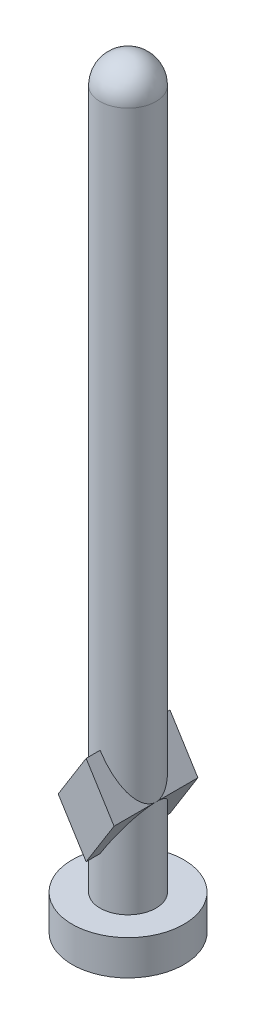
ISO-10303-21;
HEADER;
FILE_DESCRIPTION(('STEP AP214'),'2;1');
FILE_NAME('part.step','',(''),(''),'','','');
FILE_SCHEMA(('AUTOMOTIVE_DESIGN { 1 0 10303 214 1 1 1 1 }'));
ENDSEC;
DATA;
#1=APPLICATION_CONTEXT('core data for automotive mechanical design processes');
#2=APPLICATION_PROTOCOL_DEFINITION('international standard','automotive_design',2000,#1);
#3=PRODUCT_CONTEXT('',#1,'mechanical');
#4=PRODUCT('Part','Part','',(#3));
#5=PRODUCT_RELATED_PRODUCT_CATEGORY('part','',(#4));
#6=PRODUCT_DEFINITION_FORMATION('','',#4);
#7=PRODUCT_DEFINITION_CONTEXT('part definition',#1,'design');
#8=PRODUCT_DEFINITION('design','',#6,#7);
#9=PRODUCT_DEFINITION_SHAPE('','',#8);
#10=(LENGTH_UNIT() NAMED_UNIT(*) SI_UNIT(.MILLI.,.METRE.));
#11=(NAMED_UNIT(*) PLANE_ANGLE_UNIT() SI_UNIT($,.RADIAN.));
#12=(NAMED_UNIT(*) SI_UNIT($,.STERADIAN.) SOLID_ANGLE_UNIT());
#13=UNCERTAINTY_MEASURE_WITH_UNIT(LENGTH_MEASURE(1.E-05),#10,'distance_accuracy_value','');
#14=(GEOMETRIC_REPRESENTATION_CONTEXT(3) GLOBAL_UNCERTAINTY_ASSIGNED_CONTEXT((#13)) GLOBAL_UNIT_ASSIGNED_CONTEXT((#10,
#11,#12)) REPRESENTATION_CONTEXT('',''));
#15=CARTESIAN_POINT('',(0.,0.,0.));
#16=DIRECTION('',(0.,0.,1.));
#17=DIRECTION('',(1.,0.,0.));
#18=AXIS2_PLACEMENT_3D('',#15,#16,#17);
#19=CARTESIAN_POINT('',(0.,100.,0.));
#20=DIRECTION('',(0.,-1.,0.));
#21=DIRECTION('',(0.,0.,-1.));
#22=AXIS2_PLACEMENT_3D('',#19,#20,#21);
#23=CYLINDRICAL_SURFACE('',#22,4.);
#24=CARTESIAN_POINT('',(0.,6.75940967701019,0.));
#25=DIRECTION('',(-0.848236351407123,-0.529617873708518,0.));
#26=DIRECTION('',(0.529617873708518,-0.848236351407123,0.));
#27=AXIS2_PLACEMENT_3D('',#24,#25,#26);
#28=ELLIPSE('',#27,7.55261519402847,4.);
#29=CARTESIAN_POINT('',(-4.,13.1658124327749,0.));
#30=VERTEX_POINT('',#29);
#31=CARTESIAN_POINT('',(0.,6.75940967701025,-4.));
#32=VERTEX_POINT('',#31);
#33=EDGE_CURVE('E157',#30,#32,#28,.T.);
#34=ORIENTED_EDGE('',*,*,#33,.T.);
#35=CARTESIAN_POINT('',(0.,6.7594096770103,0.));
#36=DIRECTION('',(0.848236351407119,-0.529617873708525,0.));
#37=DIRECTION('',(-0.529617873708525,-0.848236351407119,0.));
#38=AXIS2_PLACEMENT_3D('',#35,#36,#37);
#39=ELLIPSE('',#38,7.55261519402837,4.);
#40=CARTESIAN_POINT('',(4.,13.1658124327749,0.));
#41=VERTEX_POINT('',#40);
#42=EDGE_CURVE('E50',#32,#41,#39,.T.);
#43=ORIENTED_EDGE('',*,*,#42,.T.);
#44=CARTESIAN_POINT('',(0.,6.75940967701025,4.));
#45=VERTEX_POINT('',#44);
#46=EDGE_CURVE('E160',#41,#45,#39,.T.);
#47=ORIENTED_EDGE('',*,*,#46,.T.);
#48=EDGE_CURVE('E159',#45,#30,#28,.T.);
#49=ORIENTED_EDGE('',*,*,#48,.T.);
#50=EDGE_LOOP('',(#34,#43,#47,#49));
#51=FACE_BOUND('',#50,.T.);
#52=CARTESIAN_POINT('',(0.,0.,0.));
#53=DIRECTION('',(0.,-1.,0.));
#54=DIRECTION('',(0.,0.,-1.));
#55=AXIS2_PLACEMENT_3D('',#52,#53,#54);
#56=CIRCLE('',#55,4.);
#57=CARTESIAN_POINT('',(0.,0.,-4.));
#58=VERTEX_POINT('',#57);
#59=EDGE_CURVE('E149',#58,#58,#56,.T.);
#60=ORIENTED_EDGE('',*,*,#59,.F.);
#61=EDGE_LOOP('',(#60));
#62=FACE_BOUND('',#61,.T.);
#63=ADVANCED_FACE('F33',(#51,#62),#23,.T.);
#64=CARTESIAN_POINT('',(0.,0.,0.));
#65=DIRECTION('',(0.,-1.,0.));
#66=DIRECTION('',(0.,0.,-1.));
#67=AXIS2_PLACEMENT_3D('',#64,#65,#66);
#68=PLANE('',#67);
#69=CARTESIAN_POINT('',(0.,0.,0.));
#70=DIRECTION('',(0.,-1.,0.));
#71=DIRECTION('',(0.,0.,-1.));
#72=AXIS2_PLACEMENT_3D('',#69,#70,#71);
#73=CIRCLE('',#72,8.);
#74=CARTESIAN_POINT('',(0.,0.,-8.));
#75=VERTEX_POINT('',#74);
#76=EDGE_CURVE('E138',#75,#75,#73,.T.);
#77=ORIENTED_EDGE('',*,*,#76,.F.);
#78=EDGE_LOOP('',(#77));
#79=FACE_BOUND('',#78,.T.);
#80=ORIENTED_EDGE('',*,*,#59,.T.);
#81=EDGE_LOOP('',(#80));
#82=FACE_BOUND('',#81,.T.);
#83=ADVANCED_FACE('F196',(#79,#82),#68,.F.);
#84=CARTESIAN_POINT('',(0.,-5.,0.));
#85=DIRECTION('',(0.,1.,0.));
#86=DIRECTION('',(0.,0.,1.));
#87=AXIS2_PLACEMENT_3D('',#84,#85,#86);
#88=CYLINDRICAL_SURFACE('',#87,8.);
#89=CARTESIAN_POINT('',(0.,-5.,0.));
#90=DIRECTION('',(0.,-1.,0.));
#91=DIRECTION('',(0.,0.,-1.));
#92=AXIS2_PLACEMENT_3D('',#89,#90,#91);
#93=CIRCLE('',#92,8.);
#94=CARTESIAN_POINT('',(0.,-5.,-8.));
#95=VERTEX_POINT('',#94);
#96=EDGE_CURVE('E146',#95,#95,#93,.T.);
#97=ORIENTED_EDGE('',*,*,#96,.F.);
#98=EDGE_LOOP('',(#97));
#99=FACE_BOUND('',#98,.T.);
#100=ORIENTED_EDGE('',*,*,#76,.T.);
#101=EDGE_LOOP('',(#100));
#102=FACE_BOUND('',#101,.T.);
#103=ADVANCED_FACE('F202',(#99,#102),#88,.T.);
#104=CARTESIAN_POINT('',(0.,-5.,0.));
#105=DIRECTION('',(0.,-1.,0.));
#106=DIRECTION('',(0.,0.,-1.));
#107=AXIS2_PLACEMENT_3D('',#104,#105,#106);
#108=PLANE('',#107);
#109=ORIENTED_EDGE('',*,*,#96,.T.);
#110=EDGE_LOOP('',(#109));
#111=FACE_BOUND('',#110,.T.);
#112=ADVANCED_FACE('F223',(#111),#108,.T.);
#113=CARTESIAN_POINT('',(0.,0.,-6.));
#114=DIRECTION('',(0.,0.,1.));
#115=DIRECTION('',(1.,0.,0.));
#116=AXIS2_PLACEMENT_3D('',#113,#114,#115);
#117=PLANE('',#116);
#118=DIRECTION('',(-0.529617873708525,-0.848236351407118,0.));
#119=VECTOR('',#118,1.);
#120=CARTESIAN_POINT('',(0.,19.5722151885395,-6.));
#121=LINE('',#120,#119);
#122=CARTESIAN_POINT('',(0.,19.5722151885395,-6.));
#123=VERTEX_POINT('',#122);
#124=CARTESIAN_POINT('',(-4.,13.1658124327749,-6.));
#125=VERTEX_POINT('',#124);
#126=EDGE_CURVE('E125',#123,#125,#121,.T.);
#127=ORIENTED_EDGE('',*,*,#126,.F.);
#128=DIRECTION('',(-0.529617873708518,0.848236351407123,0.));
#129=VECTOR('',#128,1.);
#130=CARTESIAN_POINT('',(4.,13.1658124327749,-6.));
#131=LINE('',#130,#129);
#132=CARTESIAN_POINT('',(4.,13.1658124327749,-6.));
#133=VERTEX_POINT('',#132);
#134=EDGE_CURVE('E105',#133,#123,#131,.T.);
#135=ORIENTED_EDGE('',*,*,#134,.F.);
#136=DIRECTION('',(0.529617873708525,0.848236351407119,0.));
#137=VECTOR('',#136,1.);
#138=CARTESIAN_POINT('',(0.,6.75940967701025,-6.));
#139=LINE('',#138,#137);
#140=CARTESIAN_POINT('',(0.,6.75940967701025,-6.));
#141=VERTEX_POINT('',#140);
#142=EDGE_CURVE('E130',#141,#133,#139,.T.);
#143=ORIENTED_EDGE('',*,*,#142,.F.);
#144=DIRECTION('',(0.529617873708518,-0.848236351407123,0.));
#145=VECTOR('',#144,1.);
#146=CARTESIAN_POINT('',(-4.,13.1658124327749,-6.));
#147=LINE('',#146,#145);
#148=EDGE_CURVE('E128',#125,#141,#147,.T.);
#149=ORIENTED_EDGE('',*,*,#148,.F.);
#150=EDGE_LOOP('',(#127,#135,#143,#149));
#151=FACE_BOUND('',#150,.T.);
#152=ADVANCED_FACE('F175',(#151),#117,.F.);
#153=CARTESIAN_POINT('',(-4.,13.1658124327749,-6.));
#154=DIRECTION('',(-0.848236351407123,-0.529617873708518,0.));
#155=DIRECTION('',(0.529617873708518,-0.848236351407123,0.));
#156=AXIS2_PLACEMENT_3D('',#153,#154,#155);
#157=PLANE('',#156);
#158=ORIENTED_EDGE('',*,*,#33,.F.);
#159=DIRECTION('',(0.,0.,1.));
#160=VECTOR('',#159,1.);
#161=CARTESIAN_POINT('',(-4.,13.1658124327749,-6.));
#162=LINE('',#161,#160);
#163=EDGE_CURVE('E104',#125,#30,#162,.T.);
#164=ORIENTED_EDGE('',*,*,#163,.F.);
#165=ORIENTED_EDGE('',*,*,#148,.T.);
#166=DIRECTION('',(0.,0.,1.));
#167=VECTOR('',#166,1.);
#168=CARTESIAN_POINT('',(0.,6.75940967701025,-6.));
#169=LINE('',#168,#167);
#170=EDGE_CURVE('E58',#141,#32,#169,.T.);
#171=ORIENTED_EDGE('',*,*,#170,.T.);
#172=EDGE_LOOP('',(#158,#164,#165,#171));
#173=FACE_BOUND('',#172,.T.);
#174=ADVANCED_FACE('F177',(#173),#157,.T.);
#175=CARTESIAN_POINT('',(0.,6.75940967701025,-6.));
#176=DIRECTION('',(0.848236351407119,-0.529617873708525,0.));
#177=DIRECTION('',(0.529617873708525,0.848236351407119,0.));
#178=AXIS2_PLACEMENT_3D('',#175,#176,#177);
#179=PLANE('',#178);
#180=ORIENTED_EDGE('',*,*,#42,.F.);
#181=ORIENTED_EDGE('',*,*,#170,.F.);
#182=ORIENTED_EDGE('',*,*,#142,.T.);
#183=DIRECTION('',(0.,0.,1.));
#184=VECTOR('',#183,1.);
#185=CARTESIAN_POINT('',(4.,13.1658124327749,-6.));
#186=LINE('',#185,#184);
#187=EDGE_CURVE('E140',#133,#41,#186,.T.);
#188=ORIENTED_EDGE('',*,*,#187,.T.);
#189=EDGE_LOOP('',(#180,#181,#182,#188));
#190=FACE_BOUND('',#189,.T.);
#191=ADVANCED_FACE('F191',(#190),#179,.T.);
#192=CARTESIAN_POINT('',(4.,13.1658124327749,-6.));
#193=DIRECTION('',(0.848236351407123,0.529617873708518,0.));
#194=DIRECTION('',(-0.529617873708518,0.848236351407123,0.));
#195=AXIS2_PLACEMENT_3D('',#192,#193,#194);
#196=PLANE('',#195);
#197=CARTESIAN_POINT('',(0.,19.5722151885396,0.));
#198=DIRECTION('',(0.848236351407123,0.529617873708518,0.));
#199=DIRECTION('',(0.529617873708518,-0.848236351407123,0.));
#200=AXIS2_PLACEMENT_3D('',#197,#198,#199);
#201=ELLIPSE('',#200,7.55261519402846,4.);
#202=CARTESIAN_POINT('',(0.,19.5722151885395,-4.));
#203=VERTEX_POINT('',#202);
#204=EDGE_CURVE('E11',#41,#203,#201,.T.);
#205=ORIENTED_EDGE('',*,*,#204,.F.);
#206=ORIENTED_EDGE('',*,*,#187,.F.);
#207=ORIENTED_EDGE('',*,*,#134,.T.);
#208=DIRECTION('',(0.,0.,1.));
#209=VECTOR('',#208,1.);
#210=CARTESIAN_POINT('',(0.,19.5722151885395,-6.));
#211=LINE('',#210,#209);
#212=EDGE_CURVE('E135',#123,#203,#211,.T.);
#213=ORIENTED_EDGE('',*,*,#212,.T.);
#214=EDGE_LOOP('',(#205,#206,#207,#213));
#215=FACE_BOUND('',#214,.T.);
#216=ADVANCED_FACE('F171',(#215),#196,.T.);
#217=CARTESIAN_POINT('',(0.,19.5722151885395,-6.));
#218=DIRECTION('',(-0.848236351407119,0.529617873708525,0.));
#219=DIRECTION('',(-0.529617873708525,-0.848236351407119,0.));
#220=AXIS2_PLACEMENT_3D('',#217,#218,#219);
#221=PLANE('',#220);
#222=CARTESIAN_POINT('',(0.,19.5722151885395,0.));
#223=DIRECTION('',(-0.848236351407119,0.529617873708525,0.));
#224=DIRECTION('',(-0.529617873708525,-0.848236351407119,0.));
#225=AXIS2_PLACEMENT_3D('',#222,#223,#224);
#226=ELLIPSE('',#225,7.55261519402836,4.);
#227=EDGE_CURVE('E42',#203,#30,#226,.T.);
#228=ORIENTED_EDGE('',*,*,#227,.F.);
#229=ORIENTED_EDGE('',*,*,#212,.F.);
#230=ORIENTED_EDGE('',*,*,#126,.T.);
#231=ORIENTED_EDGE('',*,*,#163,.T.);
#232=EDGE_LOOP('',(#228,#229,#230,#231));
#233=FACE_BOUND('',#232,.T.);
#234=ADVANCED_FACE('F167',(#233),#221,.T.);
#235=CARTESIAN_POINT('',(0.,19.5722151885395,4.));
#236=VERTEX_POINT('',#235);
#237=EDGE_CURVE('E37',#30,#236,#226,.T.);
#238=ORIENTED_EDGE('',*,*,#237,.F.);
#239=CARTESIAN_POINT('',(-4.,13.1658124327749,6.));
#240=VERTEX_POINT('',#239);
#241=EDGE_CURVE('E96',#30,#240,#162,.T.);
#242=ORIENTED_EDGE('',*,*,#241,.T.);
#243=DIRECTION('',(-0.529617873708525,-0.848236351407118,0.));
#244=VECTOR('',#243,1.);
#245=CARTESIAN_POINT('',(0.,19.5722151885395,6.));
#246=LINE('',#245,#244);
#247=CARTESIAN_POINT('',(0.,19.5722151885395,6.));
#248=VERTEX_POINT('',#247);
#249=EDGE_CURVE('E101',#248,#240,#246,.T.);
#250=ORIENTED_EDGE('',*,*,#249,.F.);
#251=EDGE_CURVE('E139',#236,#248,#211,.T.);
#252=ORIENTED_EDGE('',*,*,#251,.F.);
#253=EDGE_LOOP('',(#238,#242,#250,#252));
#254=FACE_BOUND('',#253,.T.);
#255=ADVANCED_FACE('F98',(#254),#221,.T.);
#256=EDGE_CURVE('E43',#236,#41,#201,.T.);
#257=ORIENTED_EDGE('',*,*,#256,.F.);
#258=ORIENTED_EDGE('',*,*,#251,.T.);
#259=DIRECTION('',(-0.529617873708518,0.848236351407123,0.));
#260=VECTOR('',#259,1.);
#261=CARTESIAN_POINT('',(4.,13.1658124327749,6.));
#262=LINE('',#261,#260);
#263=CARTESIAN_POINT('',(4.,13.1658124327749,6.));
#264=VERTEX_POINT('',#263);
#265=EDGE_CURVE('E120',#264,#248,#262,.T.);
#266=ORIENTED_EDGE('',*,*,#265,.F.);
#267=EDGE_CURVE('E143',#41,#264,#186,.T.);
#268=ORIENTED_EDGE('',*,*,#267,.F.);
#269=EDGE_LOOP('',(#257,#258,#266,#268));
#270=FACE_BOUND('',#269,.T.);
#271=ADVANCED_FACE('F183',(#270),#196,.T.);
#272=ORIENTED_EDGE('',*,*,#46,.F.);
#273=ORIENTED_EDGE('',*,*,#267,.T.);
#274=DIRECTION('',(0.529617873708525,0.848236351407119,0.));
#275=VECTOR('',#274,1.);
#276=CARTESIAN_POINT('',(0.,6.75940967701025,6.));
#277=LINE('',#276,#275);
#278=CARTESIAN_POINT('',(0.,6.75940967701025,6.));
#279=VERTEX_POINT('',#278);
#280=EDGE_CURVE('E115',#279,#264,#277,.T.);
#281=ORIENTED_EDGE('',*,*,#280,.F.);
#282=EDGE_CURVE('E111',#45,#279,#169,.T.);
#283=ORIENTED_EDGE('',*,*,#282,.F.);
#284=EDGE_LOOP('',(#272,#273,#281,#283));
#285=FACE_BOUND('',#284,.T.);
#286=ADVANCED_FACE('F180',(#285),#179,.T.);
#287=ORIENTED_EDGE('',*,*,#48,.F.);
#288=ORIENTED_EDGE('',*,*,#282,.T.);
#289=DIRECTION('',(0.529617873708518,-0.848236351407123,0.));
#290=VECTOR('',#289,1.);
#291=CARTESIAN_POINT('',(-4.,13.1658124327749,6.));
#292=LINE('',#291,#290);
#293=EDGE_CURVE('E108',#240,#279,#292,.T.);
#294=ORIENTED_EDGE('',*,*,#293,.F.);
#295=ORIENTED_EDGE('',*,*,#241,.F.);
#296=EDGE_LOOP('',(#287,#288,#294,#295));
#297=FACE_BOUND('',#296,.T.);
#298=ADVANCED_FACE('F109',(#297),#157,.T.);
#299=CARTESIAN_POINT('',(0.,0.,6.));
#300=DIRECTION('',(0.,0.,1.));
#301=DIRECTION('',(1.,0.,0.));
#302=AXIS2_PLACEMENT_3D('',#299,#300,#301);
#303=PLANE('',#302);
#304=ORIENTED_EDGE('',*,*,#249,.T.);
#305=ORIENTED_EDGE('',*,*,#293,.T.);
#306=ORIENTED_EDGE('',*,*,#280,.T.);
#307=ORIENTED_EDGE('',*,*,#265,.T.);
#308=EDGE_LOOP('',(#304,#305,#306,#307));
#309=FACE_BOUND('',#308,.T.);
#310=ADVANCED_FACE('F118',(#309),#303,.T.);
#311=CARTESIAN_POINT('',(0.,100.,0.));
#312=DIRECTION('',(0.,0.,1.));
#313=DIRECTION('',(1.,0.,0.));
#314=AXIS2_PLACEMENT_3D('',#311,#312,#313);
#315=SPHERICAL_SURFACE('',#314,4.);
#316=CARTESIAN_POINT('',(0.,100.,0.));
#317=DIRECTION('',(0.,1.,0.));
#318=DIRECTION('',(0.,0.,1.));
#319=AXIS2_PLACEMENT_3D('',#316,#317,#318);
#320=SPHERICAL_SURFACE('',#319,4.);
#321=CARTESIAN_POINT('',(0.,100.,0.));
#322=DIRECTION('',(0.,1.,0.));
#323=DIRECTION('',(0.,0.,1.));
#324=AXIS2_PLACEMENT_3D('',#321,#322,#323);
#325=CIRCLE('',#324,4.);
#326=CARTESIAN_POINT('',(0.,100.,4.));
#327=VERTEX_POINT('',#326);
#328=EDGE_CURVE('E154',#327,#327,#325,.T.);
#329=ORIENTED_EDGE('',*,*,#328,.T.);
#330=EDGE_LOOP('',(#329));
#331=FACE_BOUND('',#330,.T.);
#332=ADVANCED_FACE('F35',(#331),#320,.T.);
#333=ORIENTED_EDGE('',*,*,#328,.F.);
#334=EDGE_LOOP('',(#333));
#335=FACE_BOUND('',#334,.T.);
#336=ORIENTED_EDGE('',*,*,#256,.T.);
#337=ORIENTED_EDGE('',*,*,#204,.T.);
#338=ORIENTED_EDGE('',*,*,#227,.T.);
#339=ORIENTED_EDGE('',*,*,#237,.T.);
#340=EDGE_LOOP('',(#336,#337,#338,#339));
#341=FACE_BOUND('',#340,.T.);
#342=ADVANCED_FACE('F164',(#335,#341),#23,.T.);
#343=CLOSED_SHELL('',(#63,#83,#103,#112,#152,#174,#191,#216,#234,#255,#271,#286,#298,#310,#332,#342));
#344=MANIFOLD_SOLID_BREP('B2',#343);
#345=ADVANCED_BREP_SHAPE_REPRESENTATION('',(#18,#344),#14);
#346=SHAPE_DEFINITION_REPRESENTATION(#9,#345);
ENDSEC;
END-ISO-10303-21;
